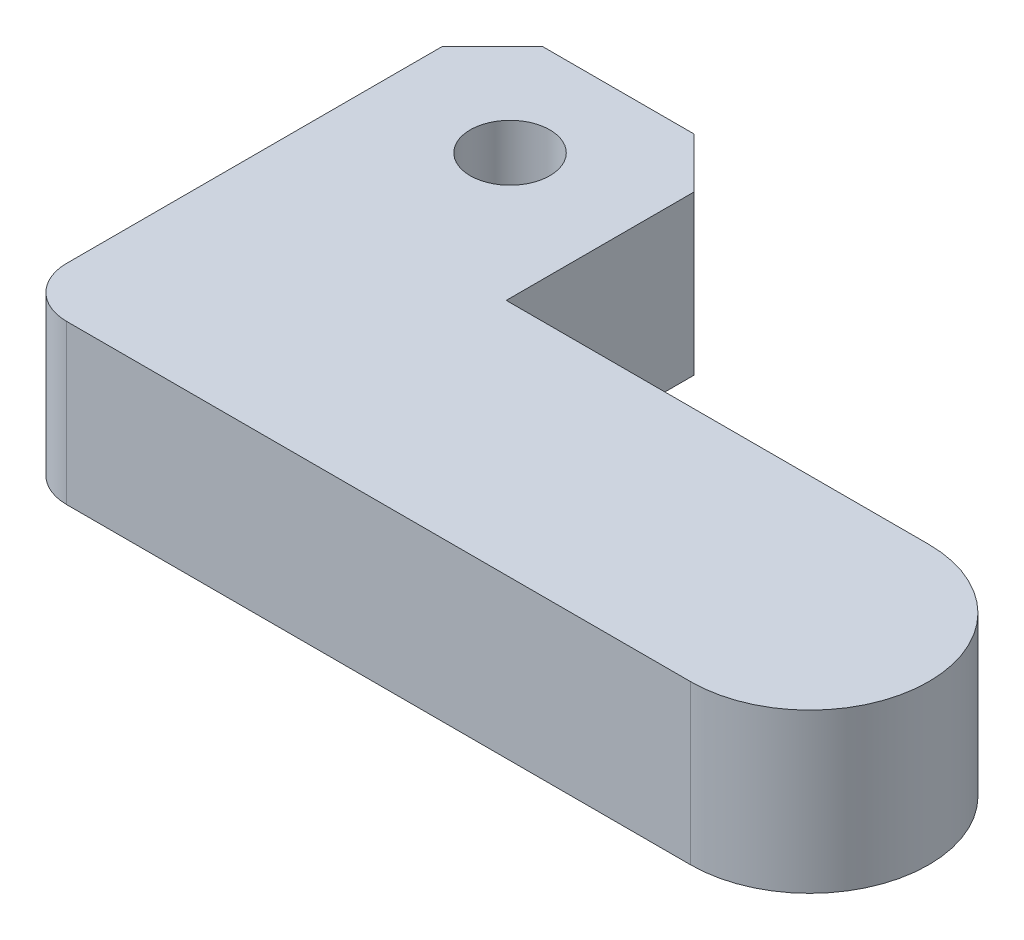
ISO-10303-21;
HEADER;
FILE_DESCRIPTION(('STEP AP214'),'2;1');
FILE_NAME('part.step','',(''),(''),'','','');
FILE_SCHEMA(('AUTOMOTIVE_DESIGN { 1 0 10303 214 1 1 1 1 }'));
ENDSEC;
DATA;
#1=APPLICATION_CONTEXT('core data for automotive mechanical design processes');
#2=APPLICATION_PROTOCOL_DEFINITION('international standard','automotive_design',2000,#1);
#3=PRODUCT_CONTEXT('',#1,'mechanical');
#4=PRODUCT('Part','Part','',(#3));
#5=PRODUCT_RELATED_PRODUCT_CATEGORY('part','',(#4));
#6=PRODUCT_DEFINITION_FORMATION('','',#4);
#7=PRODUCT_DEFINITION_CONTEXT('part definition',#1,'design');
#8=PRODUCT_DEFINITION('design','',#6,#7);
#9=PRODUCT_DEFINITION_SHAPE('','',#8);
#10=(LENGTH_UNIT() NAMED_UNIT(*) SI_UNIT(.MILLI.,.METRE.));
#11=(NAMED_UNIT(*) PLANE_ANGLE_UNIT() SI_UNIT($,.RADIAN.));
#12=(NAMED_UNIT(*) SI_UNIT($,.STERADIAN.) SOLID_ANGLE_UNIT());
#13=UNCERTAINTY_MEASURE_WITH_UNIT(LENGTH_MEASURE(1.E-05),#10,'distance_accuracy_value','');
#14=(GEOMETRIC_REPRESENTATION_CONTEXT(3) GLOBAL_UNCERTAINTY_ASSIGNED_CONTEXT((#13)) GLOBAL_UNIT_ASSIGNED_CONTEXT((#10,
#11,#12)) REPRESENTATION_CONTEXT('',''));
#15=CARTESIAN_POINT('',(0.,0.,0.));
#16=DIRECTION('',(0.,0.,1.));
#17=DIRECTION('',(1.,0.,0.));
#18=AXIS2_PLACEMENT_3D('',#15,#16,#17);
#19=CARTESIAN_POINT('',(42.5,10.,-7.5));
#20=DIRECTION('',(0.,1.,0.));
#21=DIRECTION('',(0.,0.,1.));
#22=AXIS2_PLACEMENT_3D('',#19,#20,#21);
#23=PLANE('',#22);
#24=DIRECTION('',(-1.,0.,0.));
#25=VECTOR('',#24,1.);
#26=CARTESIAN_POINT('',(15.875,10.,-30.));
#27=LINE('',#26,#25);
#28=CARTESIAN_POINT('',(12.7,10.,-30.));
#29=VERTEX_POINT('',#28);
#30=CARTESIAN_POINT('',(3.175,10.,-30.));
#31=VERTEX_POINT('',#30);
#32=EDGE_CURVE('E150',#29,#31,#27,.T.);
#33=ORIENTED_EDGE('',*,*,#32,.T.);
#34=DIRECTION('',(0.707106781186548,0.,-0.707106781186547));
#35=VECTOR('',#34,1.);
#36=CARTESIAN_POINT('',(11.5875,10.,-38.4125));
#37=LINE('',#36,#35);
#38=CARTESIAN_POINT('',(0.,10.,-26.825));
#39=VERTEX_POINT('',#38);
#40=EDGE_CURVE('E40',#31,#39,#37,.F.);
#41=ORIENTED_EDGE('',*,*,#40,.T.);
#42=DIRECTION('',(0.,0.,1.));
#43=VECTOR('',#42,1.);
#44=CARTESIAN_POINT('',(0.,10.,-30.));
#45=LINE('',#44,#43);
#46=CARTESIAN_POINT('',(0.,10.,-3.175));
#47=VERTEX_POINT('',#46);
#48=EDGE_CURVE('E115',#39,#47,#45,.T.);
#49=ORIENTED_EDGE('',*,*,#48,.T.);
#50=CARTESIAN_POINT('',(3.175,10.,-3.175));
#51=DIRECTION('',(0.,1.,0.));
#52=DIRECTION('',(0.,0.,1.));
#53=AXIS2_PLACEMENT_3D('',#50,#51,#52);
#54=CIRCLE('',#53,3.175);
#55=CARTESIAN_POINT('',(3.175,10.,0.));
#56=VERTEX_POINT('',#55);
#57=EDGE_CURVE('E111',#47,#56,#54,.T.);
#58=ORIENTED_EDGE('',*,*,#57,.T.);
#59=DIRECTION('',(1.,0.,0.));
#60=VECTOR('',#59,1.);
#61=CARTESIAN_POINT('',(0.,10.,0.));
#62=LINE('',#61,#60);
#63=CARTESIAN_POINT('',(42.5,10.,0.));
#64=VERTEX_POINT('',#63);
#65=EDGE_CURVE('E104',#56,#64,#62,.T.);
#66=ORIENTED_EDGE('',*,*,#65,.T.);
#67=CARTESIAN_POINT('',(42.5,10.,-7.5));
#68=DIRECTION('',(0.,1.,0.));
#69=DIRECTION('',(0.,0.,1.));
#70=AXIS2_PLACEMENT_3D('',#67,#68,#69);
#71=CIRCLE('',#70,7.5);
#72=CARTESIAN_POINT('',(42.5,10.,-15.));
#73=VERTEX_POINT('',#72);
#74=EDGE_CURVE('E108',#64,#73,#71,.T.);
#75=ORIENTED_EDGE('',*,*,#74,.T.);
#76=DIRECTION('',(-1.,0.,0.));
#77=VECTOR('',#76,1.);
#78=CARTESIAN_POINT('',(42.5,10.,-15.));
#79=LINE('',#78,#77);
#80=CARTESIAN_POINT('',(15.875,10.,-15.));
#81=VERTEX_POINT('',#80);
#82=EDGE_CURVE('E130',#73,#81,#79,.T.);
#83=ORIENTED_EDGE('',*,*,#82,.T.);
#84=DIRECTION('',(0.,0.,-1.));
#85=VECTOR('',#84,1.);
#86=CARTESIAN_POINT('',(15.875,10.,-15.));
#87=LINE('',#86,#85);
#88=CARTESIAN_POINT('',(15.875,10.,-26.825));
#89=VERTEX_POINT('',#88);
#90=EDGE_CURVE('E132',#81,#89,#87,.T.);
#91=ORIENTED_EDGE('',*,*,#90,.T.);
#92=DIRECTION('',(0.707106781186547,0.,0.707106781186548));
#93=VECTOR('',#92,1.);
#94=CARTESIAN_POINT('',(38.85,10.,-3.84999999999998));
#95=LINE('',#94,#93);
#96=EDGE_CURVE('E173',#89,#29,#95,.F.);
#97=ORIENTED_EDGE('',*,*,#96,.T.);
#98=EDGE_LOOP('',(#33,#41,#49,#58,#66,#75,#83,#91,#97));
#99=FACE_BOUND('',#98,.T.);
#100=CARTESIAN_POINT('',(7.9375,10.,-23.175));
#101=DIRECTION('',(0.,1.,0.));
#102=DIRECTION('',(0.,0.,1.));
#103=AXIS2_PLACEMENT_3D('',#100,#101,#102);
#104=CIRCLE('',#103,2.50825);
#105=CARTESIAN_POINT('',(7.9375,10.,-20.66675));
#106=VERTEX_POINT('',#105);
#107=EDGE_CURVE('E141',#106,#106,#104,.T.);
#108=ORIENTED_EDGE('',*,*,#107,.F.);
#109=EDGE_LOOP('',(#108));
#110=FACE_BOUND('',#109,.T.);
#111=ADVANCED_FACE('F32',(#99,#110),#23,.T.);
#112=CARTESIAN_POINT('',(42.5,0.,-7.5));
#113=DIRECTION('',(0.,1.,0.));
#114=DIRECTION('',(0.,0.,1.));
#115=AXIS2_PLACEMENT_3D('',#112,#113,#114);
#116=PLANE('',#115);
#117=DIRECTION('',(0.,0.,1.));
#118=VECTOR('',#117,1.);
#119=CARTESIAN_POINT('',(0.,0.,-30.));
#120=LINE('',#119,#118);
#121=CARTESIAN_POINT('',(0.,0.,-26.825));
#122=VERTEX_POINT('',#121);
#123=CARTESIAN_POINT('',(0.,0.,-3.175));
#124=VERTEX_POINT('',#123);
#125=EDGE_CURVE('E140',#122,#124,#120,.T.);
#126=ORIENTED_EDGE('',*,*,#125,.F.);
#127=DIRECTION('',(-0.707106781186548,0.,0.707106781186547));
#128=VECTOR('',#127,1.);
#129=CARTESIAN_POINT('',(0.,0.,-26.825));
#130=LINE('',#129,#128);
#131=CARTESIAN_POINT('',(3.175,0.,-30.));
#132=VERTEX_POINT('',#131);
#133=EDGE_CURVE('E167',#122,#132,#130,.F.);
#134=ORIENTED_EDGE('',*,*,#133,.T.);
#135=DIRECTION('',(-1.,0.,0.));
#136=VECTOR('',#135,1.);
#137=CARTESIAN_POINT('',(15.875,0.,-30.));
#138=LINE('',#137,#136);
#139=CARTESIAN_POINT('',(12.7,0.,-30.));
#140=VERTEX_POINT('',#139);
#141=EDGE_CURVE('E138',#140,#132,#138,.T.);
#142=ORIENTED_EDGE('',*,*,#141,.F.);
#143=DIRECTION('',(-0.707106781186547,0.,-0.707106781186548));
#144=VECTOR('',#143,1.);
#145=CARTESIAN_POINT('',(12.7,0.,-30.));
#146=LINE('',#145,#144);
#147=CARTESIAN_POINT('',(15.875,0.,-26.825));
#148=VERTEX_POINT('',#147);
#149=EDGE_CURVE('E165',#140,#148,#146,.F.);
#150=ORIENTED_EDGE('',*,*,#149,.T.);
#151=DIRECTION('',(0.,0.,-1.));
#152=VECTOR('',#151,1.);
#153=CARTESIAN_POINT('',(15.875,0.,-15.));
#154=LINE('',#153,#152);
#155=CARTESIAN_POINT('',(15.875,0.,-15.));
#156=VERTEX_POINT('',#155);
#157=EDGE_CURVE('E148',#156,#148,#154,.T.);
#158=ORIENTED_EDGE('',*,*,#157,.F.);
#159=DIRECTION('',(-1.,0.,0.));
#160=VECTOR('',#159,1.);
#161=CARTESIAN_POINT('',(42.5,0.,-15.));
#162=LINE('',#161,#160);
#163=CARTESIAN_POINT('',(42.5,0.,-15.));
#164=VERTEX_POINT('',#163);
#165=EDGE_CURVE('E146',#164,#156,#162,.T.);
#166=ORIENTED_EDGE('',*,*,#165,.F.);
#167=CARTESIAN_POINT('',(42.5,0.,-7.5));
#168=DIRECTION('',(0.,1.,0.));
#169=DIRECTION('',(0.,0.,1.));
#170=AXIS2_PLACEMENT_3D('',#167,#168,#169);
#171=CIRCLE('',#170,7.5);
#172=CARTESIAN_POINT('',(42.5,0.,0.));
#173=VERTEX_POINT('',#172);
#174=EDGE_CURVE('E144',#173,#164,#171,.T.);
#175=ORIENTED_EDGE('',*,*,#174,.F.);
#176=DIRECTION('',(1.,0.,0.));
#177=VECTOR('',#176,1.);
#178=CARTESIAN_POINT('',(0.,0.,0.));
#179=LINE('',#178,#177);
#180=CARTESIAN_POINT('',(3.175,0.,0.));
#181=VERTEX_POINT('',#180);
#182=EDGE_CURVE('E121',#181,#173,#179,.T.);
#183=ORIENTED_EDGE('',*,*,#182,.F.);
#184=CARTESIAN_POINT('',(3.175,0.,-3.175));
#185=DIRECTION('',(0.,1.,0.));
#186=DIRECTION('',(0.,0.,1.));
#187=AXIS2_PLACEMENT_3D('',#184,#185,#186);
#188=CIRCLE('',#187,3.175);
#189=EDGE_CURVE('E155',#181,#124,#188,.F.);
#190=ORIENTED_EDGE('',*,*,#189,.T.);
#191=EDGE_LOOP('',(#126,#134,#142,#150,#158,#166,#175,#183,#190));
#192=FACE_BOUND('',#191,.T.);
#193=CARTESIAN_POINT('',(7.9375,0.,-23.175));
#194=DIRECTION('',(0.,1.,0.));
#195=DIRECTION('',(0.,0.,1.));
#196=AXIS2_PLACEMENT_3D('',#193,#194,#195);
#197=CIRCLE('',#196,2.50825);
#198=CARTESIAN_POINT('',(7.9375,0.,-20.66675));
#199=VERTEX_POINT('',#198);
#200=EDGE_CURVE('E300',#199,#199,#197,.T.);
#201=ORIENTED_EDGE('',*,*,#200,.T.);
#202=EDGE_LOOP('',(#201));
#203=FACE_BOUND('',#202,.T.);
#204=ADVANCED_FACE('F185',(#192,#203),#116,.F.);
#205=CARTESIAN_POINT('',(15.875,10.,-30.));
#206=DIRECTION('',(0.,0.,1.));
#207=DIRECTION('',(1.,0.,0.));
#208=AXIS2_PLACEMENT_3D('',#205,#206,#207);
#209=PLANE('',#208);
#210=ORIENTED_EDGE('',*,*,#141,.T.);
#211=DIRECTION('',(0.,1.,0.));
#212=VECTOR('',#211,1.);
#213=CARTESIAN_POINT('',(3.175,10.,-30.));
#214=LINE('',#213,#212);
#215=EDGE_CURVE('E53',#132,#31,#214,.T.);
#216=ORIENTED_EDGE('',*,*,#215,.T.);
#217=ORIENTED_EDGE('',*,*,#32,.F.);
#218=DIRECTION('',(0.,-1.,0.));
#219=VECTOR('',#218,1.);
#220=CARTESIAN_POINT('',(12.7,10.,-30.));
#221=LINE('',#220,#219);
#222=EDGE_CURVE('E169',#29,#140,#221,.T.);
#223=ORIENTED_EDGE('',*,*,#222,.T.);
#224=EDGE_LOOP('',(#210,#216,#217,#223));
#225=FACE_BOUND('',#224,.T.);
#226=ADVANCED_FACE('F187',(#225),#209,.F.);
#227=CARTESIAN_POINT('',(0.,10.,-30.));
#228=DIRECTION('',(1.,0.,0.));
#229=DIRECTION('',(0.,0.,-1.));
#230=AXIS2_PLACEMENT_3D('',#227,#228,#229);
#231=PLANE('',#230);
#232=ORIENTED_EDGE('',*,*,#48,.F.);
#233=DIRECTION('',(0.,-1.,0.));
#234=VECTOR('',#233,1.);
#235=CARTESIAN_POINT('',(0.,10.,-26.825));
#236=LINE('',#235,#234);
#237=EDGE_CURVE('E162',#39,#122,#236,.T.);
#238=ORIENTED_EDGE('',*,*,#237,.T.);
#239=ORIENTED_EDGE('',*,*,#125,.T.);
#240=DIRECTION('',(0.,-1.,0.));
#241=VECTOR('',#240,1.);
#242=CARTESIAN_POINT('',(0.,10.,-3.175));
#243=LINE('',#242,#241);
#244=EDGE_CURVE('E158',#124,#47,#243,.F.);
#245=ORIENTED_EDGE('',*,*,#244,.T.);
#246=EDGE_LOOP('',(#232,#238,#239,#245));
#247=FACE_BOUND('',#246,.T.);
#248=ADVANCED_FACE('F179',(#247),#231,.F.);
#249=CARTESIAN_POINT('',(0.,10.,0.));
#250=DIRECTION('',(0.,0.,-1.));
#251=DIRECTION('',(-1.,0.,0.));
#252=AXIS2_PLACEMENT_3D('',#249,#250,#251);
#253=PLANE('',#252);
#254=ORIENTED_EDGE('',*,*,#65,.F.);
#255=DIRECTION('',(0.,-1.,0.));
#256=VECTOR('',#255,1.);
#257=CARTESIAN_POINT('',(3.175,10.,0.));
#258=LINE('',#257,#256);
#259=EDGE_CURVE('E124',#56,#181,#258,.T.);
#260=ORIENTED_EDGE('',*,*,#259,.T.);
#261=ORIENTED_EDGE('',*,*,#182,.T.);
#262=DIRECTION('',(0.,-1.,0.));
#263=VECTOR('',#262,1.);
#264=CARTESIAN_POINT('',(42.5,10.,0.));
#265=LINE('',#264,#263);
#266=EDGE_CURVE('E118',#64,#173,#265,.T.);
#267=ORIENTED_EDGE('',*,*,#266,.F.);
#268=EDGE_LOOP('',(#254,#260,#261,#267));
#269=FACE_BOUND('',#268,.T.);
#270=ADVANCED_FACE('F119',(#269),#253,.F.);
#271=CARTESIAN_POINT('',(42.5,10.,-7.5));
#272=DIRECTION('',(0.,-1.,0.));
#273=DIRECTION('',(0.,0.,-1.));
#274=AXIS2_PLACEMENT_3D('',#271,#272,#273);
#275=CYLINDRICAL_SURFACE('',#274,7.5);
#276=ORIENTED_EDGE('',*,*,#174,.T.);
#277=DIRECTION('',(0.,-1.,0.));
#278=VECTOR('',#277,1.);
#279=CARTESIAN_POINT('',(42.5,10.,-15.));
#280=LINE('',#279,#278);
#281=EDGE_CURVE('E125',#73,#164,#280,.T.);
#282=ORIENTED_EDGE('',*,*,#281,.F.);
#283=ORIENTED_EDGE('',*,*,#74,.F.);
#284=ORIENTED_EDGE('',*,*,#266,.T.);
#285=EDGE_LOOP('',(#276,#282,#283,#284));
#286=FACE_BOUND('',#285,.T.);
#287=ADVANCED_FACE('F127',(#286),#275,.T.);
#288=CARTESIAN_POINT('',(42.5,10.,-15.));
#289=DIRECTION('',(0.,0.,1.));
#290=DIRECTION('',(1.,0.,0.));
#291=AXIS2_PLACEMENT_3D('',#288,#289,#290);
#292=PLANE('',#291);
#293=ORIENTED_EDGE('',*,*,#165,.T.);
#294=DIRECTION('',(0.,-1.,0.));
#295=VECTOR('',#294,1.);
#296=CARTESIAN_POINT('',(15.875,10.,-15.));
#297=LINE('',#296,#295);
#298=EDGE_CURVE('E137',#81,#156,#297,.T.);
#299=ORIENTED_EDGE('',*,*,#298,.F.);
#300=ORIENTED_EDGE('',*,*,#82,.F.);
#301=ORIENTED_EDGE('',*,*,#281,.T.);
#302=EDGE_LOOP('',(#293,#299,#300,#301));
#303=FACE_BOUND('',#302,.T.);
#304=ADVANCED_FACE('F196',(#303),#292,.F.);
#305=CARTESIAN_POINT('',(15.875,10.,-15.));
#306=DIRECTION('',(-1.,0.,0.));
#307=DIRECTION('',(0.,0.,1.));
#308=AXIS2_PLACEMENT_3D('',#305,#306,#307);
#309=PLANE('',#308);
#310=ORIENTED_EDGE('',*,*,#157,.T.);
#311=DIRECTION('',(0.,1.,0.));
#312=VECTOR('',#311,1.);
#313=CARTESIAN_POINT('',(15.875,10.,-26.825));
#314=LINE('',#313,#312);
#315=EDGE_CURVE('E11',#148,#89,#314,.T.);
#316=ORIENTED_EDGE('',*,*,#315,.T.);
#317=ORIENTED_EDGE('',*,*,#90,.F.);
#318=ORIENTED_EDGE('',*,*,#298,.T.);
#319=EDGE_LOOP('',(#310,#316,#317,#318));
#320=FACE_BOUND('',#319,.T.);
#321=ADVANCED_FACE('F193',(#320),#309,.F.);
#322=CARTESIAN_POINT('',(7.9375,10.,-23.175));
#323=DIRECTION('',(0.,-1.,0.));
#324=DIRECTION('',(0.,0.,-1.));
#325=AXIS2_PLACEMENT_3D('',#322,#323,#324);
#326=CYLINDRICAL_SURFACE('',#325,2.50825);
#327=ORIENTED_EDGE('',*,*,#107,.T.);
#328=EDGE_LOOP('',(#327));
#329=FACE_BOUND('',#328,.T.);
#330=ORIENTED_EDGE('',*,*,#200,.F.);
#331=EDGE_LOOP('',(#330));
#332=FACE_BOUND('',#331,.T.);
#333=ADVANCED_FACE('F200',(#329,#332),#326,.F.);
#334=CARTESIAN_POINT('',(3.175,10.,-3.175));
#335=DIRECTION('',(0.,-1.,0.));
#336=DIRECTION('',(0.,0.,-1.));
#337=AXIS2_PLACEMENT_3D('',#334,#335,#336);
#338=CYLINDRICAL_SURFACE('',#337,3.175);
#339=ORIENTED_EDGE('',*,*,#57,.F.);
#340=ORIENTED_EDGE('',*,*,#244,.F.);
#341=ORIENTED_EDGE('',*,*,#189,.F.);
#342=ORIENTED_EDGE('',*,*,#259,.F.);
#343=EDGE_LOOP('',(#339,#340,#341,#342));
#344=FACE_BOUND('',#343,.T.);
#345=ADVANCED_FACE('F198',(#344),#338,.T.);
#346=CARTESIAN_POINT('',(0.,10.,-26.825));
#347=DIRECTION('',(0.707106781186547,0.,0.707106781186548));
#348=DIRECTION('',(0.,-1.,0.));
#349=AXIS2_PLACEMENT_3D('',#346,#347,#348);
#350=PLANE('',#349);
#351=ORIENTED_EDGE('',*,*,#40,.F.);
#352=ORIENTED_EDGE('',*,*,#215,.F.);
#353=ORIENTED_EDGE('',*,*,#133,.F.);
#354=ORIENTED_EDGE('',*,*,#237,.F.);
#355=EDGE_LOOP('',(#351,#352,#353,#354));
#356=FACE_BOUND('',#355,.T.);
#357=ADVANCED_FACE('F182',(#356),#350,.F.);
#358=CARTESIAN_POINT('',(12.7,10.,-30.));
#359=DIRECTION('',(-0.707106781186548,0.,0.707106781186547));
#360=DIRECTION('',(0.,-1.,0.));
#361=AXIS2_PLACEMENT_3D('',#358,#359,#360);
#362=PLANE('',#361);
#363=ORIENTED_EDGE('',*,*,#96,.F.);
#364=ORIENTED_EDGE('',*,*,#315,.F.);
#365=ORIENTED_EDGE('',*,*,#149,.F.);
#366=ORIENTED_EDGE('',*,*,#222,.F.);
#367=EDGE_LOOP('',(#363,#364,#365,#366));
#368=FACE_BOUND('',#367,.T.);
#369=ADVANCED_FACE('F34',(#368),#362,.F.);
#370=CLOSED_SHELL('',(#111,#204,#226,#248,#270,#287,#304,#321,#333,#345,#357,#369));
#371=MANIFOLD_SOLID_BREP('B2',#370);
#372=ADVANCED_BREP_SHAPE_REPRESENTATION('',(#18,#371),#14);
#373=SHAPE_DEFINITION_REPRESENTATION(#9,#372);
ENDSEC;
END-ISO-10303-21;
